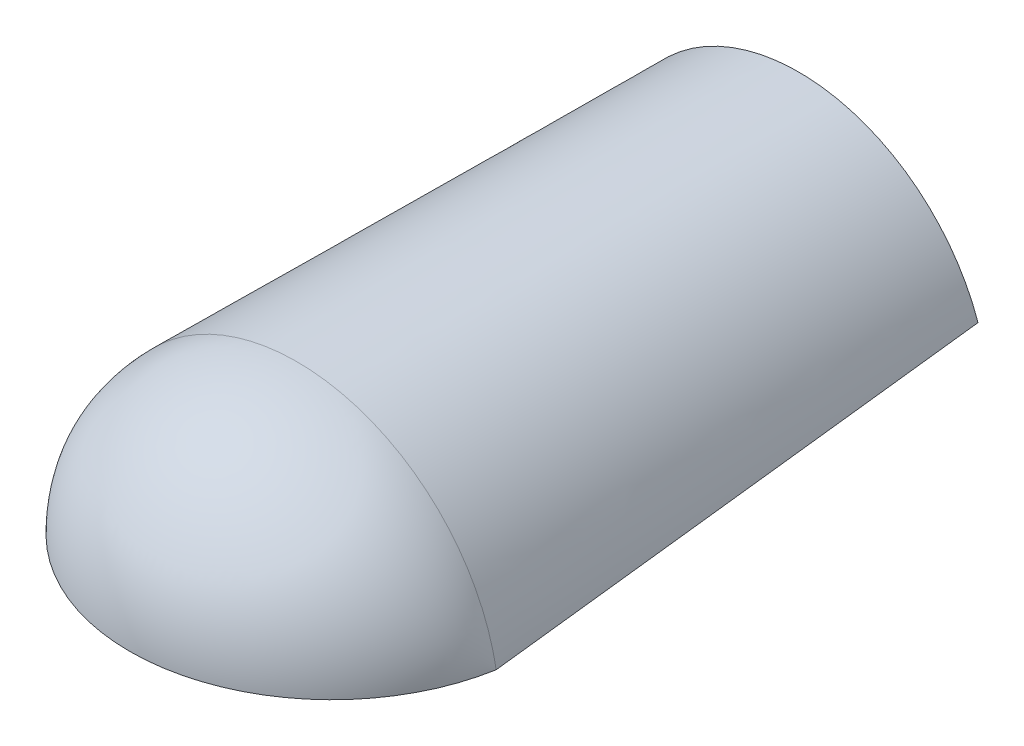
ISO-10303-21;
HEADER;
FILE_DESCRIPTION(('STEP AP214'),'2;1');
FILE_NAME('part.step','',(''),(''),'','','');
FILE_SCHEMA(('AUTOMOTIVE_DESIGN { 1 0 10303 214 1 1 1 1 }'));
ENDSEC;
DATA;
#1=APPLICATION_CONTEXT('core data for automotive mechanical design processes');
#2=APPLICATION_PROTOCOL_DEFINITION('international standard','automotive_design',2000,#1);
#3=PRODUCT_CONTEXT('',#1,'mechanical');
#4=PRODUCT('Part','Part','',(#3));
#5=PRODUCT_RELATED_PRODUCT_CATEGORY('part','',(#4));
#6=PRODUCT_DEFINITION_FORMATION('','',#4);
#7=PRODUCT_DEFINITION_CONTEXT('part definition',#1,'design');
#8=PRODUCT_DEFINITION('design','',#6,#7);
#9=PRODUCT_DEFINITION_SHAPE('','',#8);
#10=(LENGTH_UNIT() NAMED_UNIT(*) SI_UNIT(.MILLI.,.METRE.));
#11=(NAMED_UNIT(*) PLANE_ANGLE_UNIT() SI_UNIT($,.RADIAN.));
#12=(NAMED_UNIT(*) SI_UNIT($,.STERADIAN.) SOLID_ANGLE_UNIT());
#13=UNCERTAINTY_MEASURE_WITH_UNIT(LENGTH_MEASURE(1.E-05),#10,'distance_accuracy_value','');
#14=(GEOMETRIC_REPRESENTATION_CONTEXT(3) GLOBAL_UNCERTAINTY_ASSIGNED_CONTEXT((#13)) GLOBAL_UNIT_ASSIGNED_CONTEXT((#10,
#11,#12)) REPRESENTATION_CONTEXT('',''));
#15=CARTESIAN_POINT('',(0.,0.,0.));
#16=DIRECTION('',(0.,0.,1.));
#17=DIRECTION('',(1.,0.,0.));
#18=AXIS2_PLACEMENT_3D('',#15,#16,#17);
#19=CARTESIAN_POINT('',(125.,0.,-21.9047619047619));
#20=DIRECTION('',(0.,-1.,0.));
#21=DIRECTION('',(0.,0.,1.));
#22=AXIS2_PLACEMENT_3D('',#19,#20,#21);
#23=CIRCLE('',#22,126.904761904762);
#24=TRIMMED_CURVE('',#23,(PARAMETER_VALUE(-1.39731964944293)),
(PARAMETER_VALUE(1.39731964944293)),.T.,.PARAMETER.);
#25=CARTESIAN_POINT('',(125.,0.,0.));
#26=DIRECTION('',(-1.,0.,0.));
#27=AXIS1_PLACEMENT('',#25,#26);
#28=SURFACE_OF_REVOLUTION('',#24,#27);
#29=CARTESIAN_POINT('',(0.,0.,0.));
#30=CARTESIAN_POINT('',(0.898999374609131,5.13015947467167,0.));
#31=CARTESIAN_POINT('',(2.15965012983615,10.4731894749804,0.));
#32=CARTESIAN_POINT('',(5.60301441592827,21.4823689661564,0.));
#33=CARTESIAN_POINT('',(7.78666650616073,27.1492286482549,0.));
#34=CARTESIAN_POINT('',(13.2778334580457,38.6214063291952,0.));
#35=CARTESIAN_POINT('',(16.5868849935141,44.4270636661809,0.));
#36=CARTESIAN_POINT('',(22.518659414071,53.0253216700943,0.));
#37=CARTESIAN_POINT('',(24.6568615101316,55.8722105933577,0.));
#38=CARTESIAN_POINT('',(29.2681133264981,61.4823400169498,0.));
#39=CARTESIAN_POINT('',(31.7412276913879,64.2455454841741,0.));
#40=CARTESIAN_POINT('',(37.027898456181,69.6374874978048,0.));
#41=CARTESIAN_POINT('',(39.8415147989359,72.2661671666139,0.));
#42=CARTESIAN_POINT('',(45.8053969730578,77.3340729095938,0.));
#43=CARTESIAN_POINT('',(48.9557100148846,79.7732200709137,0.));
#44=CARTESIAN_POINT('',(55.5781661251231,84.4049509131887,0.));
#45=CARTESIAN_POINT('',(59.0503349470975,86.5974367213035,0.));
#46=CARTESIAN_POINT('',(66.2895276460907,90.6792772094084,0.));
#47=CARTESIAN_POINT('',(70.0565478849854,92.5685219287518,0.));
#48=CARTESIAN_POINT('',(77.8459518755739,95.9910030209656,0.));
#49=CARTESIAN_POINT('',(81.8682972795076,97.5241277879856,0.));
#50=CARTESIAN_POINT('',(90.1169560305692,100.188549608351,0.));
#51=CARTESIAN_POINT('',(94.3431953545311,101.3197462266,0.));
#52=CARTESIAN_POINT('',(102.938029145358,103.144782345888,0.));
#53=CARTESIAN_POINT('',(107.306518379128,103.838545671315,0.));
#54=CARTESIAN_POINT('',(116.116733782103,104.76617506715,0.));
#55=CARTESIAN_POINT('',(120.558333333333,105.,0.));
#56=CARTESIAN_POINT('',(129.441666666667,105.,0.));
#57=CARTESIAN_POINT('',(133.883266217897,104.76617506715,0.));
#58=CARTESIAN_POINT('',(142.693481620872,103.838545671315,0.));
#59=CARTESIAN_POINT('',(147.061970854642,103.144782345889,0.));
#60=CARTESIAN_POINT('',(155.656804645469,101.3197462266,0.));
#61=CARTESIAN_POINT('',(159.883043969431,100.188549608351,0.));
#62=CARTESIAN_POINT('',(168.131702720492,97.5241277879856,0.));
#63=CARTESIAN_POINT('',(172.154048124426,95.9910030209656,0.));
#64=CARTESIAN_POINT('',(179.943452115015,92.5685219287518,0.));
#65=CARTESIAN_POINT('',(183.710472353909,90.6792772094084,0.));
#66=CARTESIAN_POINT('',(190.949665052903,86.5974367213035,0.));
#67=CARTESIAN_POINT('',(194.421833874877,84.4049509131887,0.));
#68=CARTESIAN_POINT('',(201.044289985115,79.7732200709137,0.));
#69=CARTESIAN_POINT('',(204.194603026942,77.3340729095938,0.));
#70=CARTESIAN_POINT('',(210.158485201064,72.2661671666139,0.));
#71=CARTESIAN_POINT('',(212.972101543819,69.6374874978048,0.));
#72=CARTESIAN_POINT('',(218.258772308612,64.2455454841742,0.));
#73=CARTESIAN_POINT('',(220.731886673502,61.4823400169498,0.));
#74=CARTESIAN_POINT('',(225.343138489868,55.8722105933577,0.));
#75=CARTESIAN_POINT('',(227.481340585929,53.0253216700943,0.));
#76=CARTESIAN_POINT('',(233.413115006486,44.4270636661809,0.));
#77=CARTESIAN_POINT('',(236.722166541954,38.6214063291952,0.));
#78=CARTESIAN_POINT('',(242.213333493839,27.1492286482549,0.));
#79=CARTESIAN_POINT('',(244.396985584072,21.4823689661564,0.));
#80=CARTESIAN_POINT('',(247.840349870164,10.4731894749805,0.));
#81=CARTESIAN_POINT('',(249.101000625391,5.13015947467167,0.));
#82=CARTESIAN_POINT('',(250.,0.,0.));
#83=B_SPLINE_CURVE_WITH_KNOTS('',3,(#29,#30,#31,#32,#33,#34,#35,#36,#37,#38,#39,#40,#41,#42,#43,
#44,#45,#46,#47,#48,#49,#50,#51,#52,#53,#54,#55,#56,#57,#58,#59,#60,#61,#62,#63,#64,#65,#66,#67,
#68,#69,#70,#71,#72,#73,#74,#75,#76,#77,#78,#79,#80,#81,#82),.UNSPECIFIED.,.F.,.F.,(4,2,2,2,2,2,
2,2,2,2,2,2,2,2,2,2,2,2,2,2,2,2,2,2,2,2,4),(0.,0.0625,0.125,0.1875,0.21875,0.25,0.28125,0.3125,
0.34375,0.375,0.40625,0.4375,0.46875,0.5,0.53125,0.5625,0.59375,0.625,0.65625,0.6875,0.71875,
0.75,0.78125,0.8125,0.875,0.9375,1.),.UNSPECIFIED.);
#84=CARTESIAN_POINT('',(250.,0.,0.));
#85=VERTEX_POINT('',#84);
#86=CARTESIAN_POINT('',(0.,0.,0.));
#87=VERTEX_POINT('',#86);
#88=EDGE_CURVE('E92',#85,#87,#83,.F.);
#89=ORIENTED_EDGE('',*,*,#88,.T.);
#90=CARTESIAN_POINT('',(125.,0.,-21.9047619047619));
#91=DIRECTION('',(0.,-1.,0.));
#92=DIRECTION('',(-1.,0.,0.));
#93=AXIS2_PLACEMENT_3D('',#90,#91,#92);
#94=CIRCLE('',#93,126.904761904762);
#95=EDGE_CURVE('E131',#85,#87,#94,.T.);
#96=ORIENTED_EDGE('',*,*,#95,.F.);
#97=EDGE_LOOP('',(#89,#96));
#98=FACE_BOUND('',#97,.T.);
#99=ADVANCED_FACE('F65',(#98),#28,.T.);
#100=CARTESIAN_POINT('',(125.,0.,-21.9047619047619));
#101=DIRECTION('',(0.,-1.,0.));
#102=DIRECTION('',(0.,0.,1.));
#103=AXIS2_PLACEMENT_3D('',#100,#101,#102);
#104=CIRCLE('',#103,101.904761904762);
#105=TRIMMED_CURVE('',#104,(PARAMETER_VALUE(-1.3541523446426)),
(PARAMETER_VALUE(1.3541523446426)),.T.,.PARAMETER.);
#106=CARTESIAN_POINT('',(125.,0.,0.));
#107=DIRECTION('',(-1.,0.,0.));
#108=AXIS1_PLACEMENT('',#106,#107);
#109=SURFACE_OF_REVOLUTION('',#105,#108);
#110=CARTESIAN_POINT('',(224.522670305624,0.,0.));
#111=CARTESIAN_POINT('',(223.631306825472,4.04984423676008,0.));
#112=CARTESIAN_POINT('',(222.449262678906,8.24616676603677,0.));
#113=CARTESIAN_POINT('',(219.361557672107,16.8422861127023,0.));
#114=CARTESIAN_POINT('',(217.455178325375,21.2424977271868,0.));
#115=CARTESIAN_POINT('',(212.780517968589,30.097417646579,0.));
#116=CARTESIAN_POINT('',(210.011152009878,34.5522354151853,0.));
#117=CARTESIAN_POINT('',(203.504022235063,43.2980524926841,0.));
#118=CARTESIAN_POINT('',(199.764945665066,47.5885560574828,0.));
#119=CARTESIAN_POINT('',(191.280428145553,55.7227022206628,0.));
#120=CARTESIAN_POINT('',(186.533843676961,59.5650149630144,0.));
#121=CARTESIAN_POINT('',(178.711113863869,64.7525299799295,0.));
#122=CARTESIAN_POINT('',(175.987349686377,66.3855443118685,0.));
#123=CARTESIAN_POINT('',(170.328541530824,69.4199955411557,0.));
#124=CARTESIAN_POINT('',(167.393504490901,70.8213606850689,0.));
#125=CARTESIAN_POINT('',(161.341621000425,73.356088483138,0.));
#126=CARTESIAN_POINT('',(158.224803267567,74.4893798096796,0.));
#127=CARTESIAN_POINT('',(151.846701573153,76.4566773063151,0.));
#128=CARTESIAN_POINT('',(148.58546816263,77.29062028062,0.));
#129=CARTESIAN_POINT('',(141.962559339329,78.635129362407,0.));
#130=CARTESIAN_POINT('',(138.600953246763,79.1456480586955,0.));
#131=CARTESIAN_POINT('',(131.826191167963,79.8280960966815,0.));
#132=CARTESIAN_POINT('',(128.413117218815,80.,0.));
#133=CARTESIAN_POINT('',(121.586882781185,80.,0.));
#134=CARTESIAN_POINT('',(118.173808832037,79.8280960966815,0.));
#135=CARTESIAN_POINT('',(111.399046753237,79.1456480586954,0.));
#136=CARTESIAN_POINT('',(108.037440660671,78.6351293624071,0.));
#137=CARTESIAN_POINT('',(101.414531837371,77.29062028062,0.));
#138=CARTESIAN_POINT('',(98.153298426847,76.4566773063152,0.));
#139=CARTESIAN_POINT('',(91.7751967324333,74.4893798096796,0.));
#140=CARTESIAN_POINT('',(88.6583789995754,73.3560884831381,0.));
#141=CARTESIAN_POINT('',(82.6064955090993,70.821360685069,0.));
#142=CARTESIAN_POINT('',(79.6714584691765,69.4199955411557,0.));
#143=CARTESIAN_POINT('',(74.0126503136229,66.3855443118686,0.));
#144=CARTESIAN_POINT('',(71.2888861361307,64.7525299799295,0.));
#145=CARTESIAN_POINT('',(63.4661563230392,59.5650149630145,0.));
#146=CARTESIAN_POINT('',(58.7195718544469,55.7227022206629,0.));
#147=CARTESIAN_POINT('',(50.2350543349339,47.5885560574829,0.));
#148=CARTESIAN_POINT('',(46.4959777649371,43.2980524926841,0.));
#149=CARTESIAN_POINT('',(39.9888479901224,34.5522354151854,0.));
#150=CARTESIAN_POINT('',(37.2194820314106,30.0974176465791,0.));
#151=CARTESIAN_POINT('',(32.5448216746246,21.2424977271869,0.));
#152=CARTESIAN_POINT('',(30.6384423278933,16.8422861127024,0.));
#153=CARTESIAN_POINT('',(27.5507373210941,8.24616676603684,0.));
#154=CARTESIAN_POINT('',(26.3686931745278,4.04984423676016,0.));
#155=CARTESIAN_POINT('',(25.4773296943761,0.,0.));
#156=B_SPLINE_CURVE_WITH_KNOTS('',3,(#110,#111,#112,#113,#114,#115,#116,#117,#118,#119,#120,
#121,#122,#123,#124,#125,#126,#127,#128,#129,#130,#131,#132,#133,#134,#135,#136,#137,#138,#139,
#140,#141,#142,#143,#144,#145,#146,#147,#148,#149,#150,#151,#152,#153,#154,#155),.UNSPECIFIED.,
.F.,.F.,(4,2,2,2,2,2,2,2,2,2,2,2,2,2,2,2,2,2,2,2,2,2,4),(0.,0.0625,0.125,0.1875,0.25,0.3125,
0.34375,0.375,0.40625,0.4375,0.46875,0.5,0.53125,0.5625,0.59375,0.625,0.65625,0.6875,0.75,
0.8125,0.875,0.9375,1.),.UNSPECIFIED.);
#157=CARTESIAN_POINT('',(25.4773296943761,0.,0.));
#158=VERTEX_POINT('',#157);
#159=CARTESIAN_POINT('',(224.522670305624,0.,0.));
#160=VERTEX_POINT('',#159);
#161=EDGE_CURVE('E137',#158,#160,#156,.F.);
#162=ORIENTED_EDGE('',*,*,#161,.T.);
#163=CARTESIAN_POINT('',(125.,0.,-21.9047619047619));
#164=DIRECTION('',(0.,1.,0.));
#165=DIRECTION('',(-1.,0.,0.));
#166=AXIS2_PLACEMENT_3D('',#163,#164,#165);
#167=CIRCLE('',#166,101.904761904762);
#168=EDGE_CURVE('E76',#158,#160,#167,.T.);
#169=ORIENTED_EDGE('',*,*,#168,.F.);
#170=EDGE_LOOP('',(#162,#169));
#171=FACE_BOUND('',#170,.T.);
#172=ADVANCED_FACE('F67',(#171),#109,.F.);
#173=CARTESIAN_POINT('',(125.,0.,-21.9047619047619));
#174=DIRECTION('',(0.,1.,0.));
#175=DIRECTION('',(-1.,0.,0.));
#176=AXIS2_PLACEMENT_3D('',#173,#174,#175);
#177=PLANE('',#176);
#178=ORIENTED_EDGE('',*,*,#95,.T.);
#179=DIRECTION('',(-1.,0.,0.));
#180=VECTOR('',#179,1.);
#181=CARTESIAN_POINT('',(125.,0.,0.));
#182=LINE('',#181,#180);
#183=EDGE_CURVE('E124',#87,#158,#182,.F.);
#184=ORIENTED_EDGE('',*,*,#183,.T.);
#185=ORIENTED_EDGE('',*,*,#168,.T.);
#186=DIRECTION('',(-1.,0.,0.));
#187=VECTOR('',#186,1.);
#188=CARTESIAN_POINT('',(125.,0.,0.));
#189=LINE('',#188,#187);
#190=EDGE_CURVE('E12',#160,#85,#189,.F.);
#191=ORIENTED_EDGE('',*,*,#190,.T.);
#192=EDGE_LOOP('',(#178,#184,#185,#191));
#193=FACE_BOUND('',#192,.T.);
#194=ADVANCED_FACE('F140',(#193),#177,.F.);
#195=CARTESIAN_POINT('',(125.,-14.1015625000001,-315.));
#196=DIRECTION('',(0.,0.,1.));
#197=DIRECTION('',(1.,0.,0.));
#198=AXIS2_PLACEMENT_3D('',#195,#196,#197);
#199=PLANE('',#198);
#200=CARTESIAN_POINT('',(125.,-14.1015625000001,-315.));
#201=DIRECTION('',(0.,0.,-1.));
#202=DIRECTION('',(1.,0.,0.));
#203=AXIS2_PLACEMENT_3D('',#200,#201,#202);
#204=CIRCLE('',#203,119.1015625);
#205=CARTESIAN_POINT('',(12.5,25.,-315.));
#206=VERTEX_POINT('',#205);
#207=CARTESIAN_POINT('',(237.5,25.,-315.));
#208=VERTEX_POINT('',#207);
#209=EDGE_CURVE('E117',#206,#208,#204,.T.);
#210=ORIENTED_EDGE('',*,*,#209,.T.);
#211=DIRECTION('',(-1.,0.,0.));
#212=VECTOR('',#211,1.);
#213=CARTESIAN_POINT('',(237.5,25.,-315.));
#214=LINE('',#213,#212);
#215=CARTESIAN_POINT('',(210.593059736173,25.,-315.));
#216=VERTEX_POINT('',#215);
#217=EDGE_CURVE('E214',#208,#216,#214,.T.);
#218=ORIENTED_EDGE('',*,*,#217,.T.);
#219=CARTESIAN_POINT('',(125.,-14.1015625000001,-315.));
#220=DIRECTION('',(0.,0.,1.));
#221=DIRECTION('',(1.,0.,0.));
#222=AXIS2_PLACEMENT_3D('',#219,#220,#221);
#223=CIRCLE('',#222,94.1015625);
#224=CARTESIAN_POINT('',(39.4069402638275,25.,-315.));
#225=VERTEX_POINT('',#224);
#226=EDGE_CURVE('E211',#216,#225,#223,.T.);
#227=ORIENTED_EDGE('',*,*,#226,.T.);
#228=DIRECTION('',(-1.,0.,0.));
#229=VECTOR('',#228,1.);
#230=CARTESIAN_POINT('',(39.4069402638275,25.,-315.));
#231=LINE('',#230,#229);
#232=EDGE_CURVE('E111',#225,#206,#231,.T.);
#233=ORIENTED_EDGE('',*,*,#232,.T.);
#234=EDGE_LOOP('',(#210,#218,#227,#233));
#235=FACE_BOUND('',#234,.T.);
#236=ADVANCED_FACE('F172',(#235),#199,.F.);
#237=CARTESIAN_POINT('',(224.522670305624,0.,0.));
#238=CARTESIAN_POINT('',(210.593059736173,25.,-315.));
#239=CARTESIAN_POINT('',(223.631306825472,4.04984423676008,0.));
#240=CARTESIAN_POINT('',(209.111140322932,28.2439117199391,-315.));
#241=CARTESIAN_POINT('',(222.449262678906,8.24616676603677,0.));
#242=CARTESIAN_POINT('',(207.390210056382,31.5231634167147,-315.));
#243=CARTESIAN_POINT('',(219.361557672107,16.8422861127023,0.));
#244=CARTESIAN_POINT('',(203.411457315618,38.0655314362264,-315.));
#245=CARTESIAN_POINT('',(217.455178325375,21.2424977271868,0.));
#246=CARTESIAN_POINT('',(201.153269798506,41.3286196924426,-315.));
#247=CARTESIAN_POINT('',(212.780517968589,30.097417646579,0.));
#248=CARTESIAN_POINT('',(196.057830323655,47.7256996792851,-315.));
#249=CARTESIAN_POINT('',(210.011152009878,34.5522354151853,0.));
#250=CARTESIAN_POINT('',(193.220178282777,50.8594955632716,-315.));
#251=CARTESIAN_POINT('',(203.504022235063,43.2980524926841,0.));
#252=CARTESIAN_POINT('',(186.952600065985,56.861858603395,-315.));
#253=CARTESIAN_POINT('',(199.764945665066,47.5885560574828,0.));
#254=CARTESIAN_POINT('',(183.52232632854,59.7300237679969,-315.));
#255=CARTESIAN_POINT('',(191.280428145553,55.7227022206628,0.));
#256=CARTESIAN_POINT('',(176.096855438839,65.0506779863889,-315.));
#257=CARTESIAN_POINT('',(186.533843676961,59.5650149630144,0.));
#258=CARTESIAN_POINT('',(172.1014827071,67.5025735704193,-315.));
#259=CARTESIAN_POINT('',(178.711113863869,64.7525299799295,0.));
#260=CARTESIAN_POINT('',(165.741911367485,70.7563828032049,-315.));
#261=CARTESIAN_POINT('',(175.987349686377,66.3855443118685,0.));
#262=CARTESIAN_POINT('',(163.56099636701,71.7701405338807,-315.));
#263=CARTESIAN_POINT('',(170.328541530824,69.4199955411557,0.));
#264=CARTESIAN_POINT('',(159.092838275537,73.6399843415263,-315.));
#265=CARTESIAN_POINT('',(167.393504490901,70.8213606850689,0.));
#266=CARTESIAN_POINT('',(156.805595184538,74.496070418496,-315.));
#267=CARTESIAN_POINT('',(161.341621000425,73.356088483138,0.));
#268=CARTESIAN_POINT('',(152.140568596034,76.0345899588623,-315.));
#269=CARTESIAN_POINT('',(158.224803267567,74.4893798096796,0.));
#270=CARTESIAN_POINT('',(149.762896504437,76.7168670460819,-315.));
#271=CARTESIAN_POINT('',(151.846701573153,76.4566773063151,0.));
#272=CARTESIAN_POINT('',(144.938194578224,77.8965741289247,-315.));
#273=CARTESIAN_POINT('',(148.58546816263,77.29062028062,0.));
#274=CARTESIAN_POINT('',(142.491164743608,78.3940041245479,-315.));
#275=CARTESIAN_POINT('',(141.962559339329,78.635129362407,0.));
#276=CARTESIAN_POINT('',(137.548707183029,79.1931352985289,-315.));
#277=CARTESIAN_POINT('',(138.600953246763,79.1456480586955,0.));
#278=CARTESIAN_POINT('',(135.053459756865,79.4947428706443,-315.));
#279=CARTESIAN_POINT('',(131.826191167963,79.8280960966815,0.));
#280=CARTESIAN_POINT('',(130.038842730016,79.8981752213798,-315.));
#281=CARTESIAN_POINT('',(128.413117218815,80.,0.));
#282=CARTESIAN_POINT('',(127.519473129331,80.,-315.));
#283=CARTESIAN_POINT('',(121.586882781185,80.,0.));
#284=CARTESIAN_POINT('',(122.480526870669,79.9999999999999,-315.));
#285=CARTESIAN_POINT('',(118.173808832037,79.8280960966815,0.));
#286=CARTESIAN_POINT('',(119.961157269984,79.8981752213798,-315.));
#287=CARTESIAN_POINT('',(111.399046753237,79.1456480586954,0.));
#288=CARTESIAN_POINT('',(114.946540243135,79.4947428706443,-315.));
#289=CARTESIAN_POINT('',(108.037440660671,78.6351293624071,0.));
#290=CARTESIAN_POINT('',(112.451292816971,79.1931352985289,-315.));
#291=CARTESIAN_POINT('',(101.414531837371,77.29062028062,0.));
#292=CARTESIAN_POINT('',(107.508835256392,78.3940041245479,-315.));
#293=CARTESIAN_POINT('',(98.153298426847,76.4566773063152,0.));
#294=CARTESIAN_POINT('',(105.061805421776,77.8965741289247,-315.));
#295=CARTESIAN_POINT('',(91.7751967324333,74.4893798096796,0.));
#296=CARTESIAN_POINT('',(100.237103495563,76.7168670460819,-315.));
#297=CARTESIAN_POINT('',(88.6583789995754,73.3560884831381,0.));
#298=CARTESIAN_POINT('',(97.8594314039664,76.0345899588623,-315.));
#299=CARTESIAN_POINT('',(82.6064955090993,70.821360685069,0.));
#300=CARTESIAN_POINT('',(93.194404815462,74.496070418496,-315.));
#301=CARTESIAN_POINT('',(79.6714584691765,69.4199955411557,0.));
#302=CARTESIAN_POINT('',(90.9071617244634,73.6399843415263,-315.));
#303=CARTESIAN_POINT('',(74.0126503136229,66.3855443118686,0.));
#304=CARTESIAN_POINT('',(86.4390036329898,71.7701405338807,-315.));
#305=CARTESIAN_POINT('',(71.2888861361307,64.7525299799295,0.));
#306=CARTESIAN_POINT('',(84.2580886325149,70.7563828032049,-315.));
#307=CARTESIAN_POINT('',(63.4661563230392,59.5650149630145,0.));
#308=CARTESIAN_POINT('',(77.8985172929002,67.5025735704193,-315.));
#309=CARTESIAN_POINT('',(58.7195718544469,55.7227022206629,0.));
#310=CARTESIAN_POINT('',(73.9031445611609,65.050677986389,-315.));
#311=CARTESIAN_POINT('',(50.2350543349339,47.5885560574829,0.));
#312=CARTESIAN_POINT('',(66.4776736714603,59.730023767997,-315.));
#313=CARTESIAN_POINT('',(46.4959777649371,43.2980524926841,0.));
#314=CARTESIAN_POINT('',(63.047399934015,56.861858603395,-315.));
#315=CARTESIAN_POINT('',(39.9888479901224,34.5522354151854,0.));
#316=CARTESIAN_POINT('',(56.7798217172227,50.8594955632716,-315.));
#317=CARTESIAN_POINT('',(37.2194820314106,30.0974176465791,0.));
#318=CARTESIAN_POINT('',(53.9421696763452,47.7256996792851,-315.));
#319=CARTESIAN_POINT('',(32.5448216746246,21.2424977271869,0.));
#320=CARTESIAN_POINT('',(48.8467302014943,41.3286196924426,-315.));
#321=CARTESIAN_POINT('',(30.6384423278933,16.8422861127024,0.));
#322=CARTESIAN_POINT('',(46.5885426843816,38.0655314362265,-315.));
#323=CARTESIAN_POINT('',(27.5507373210941,8.24616676603684,0.));
#324=CARTESIAN_POINT('',(42.6097899436178,31.5231634167147,-315.));
#325=CARTESIAN_POINT('',(26.3686931745278,4.04984423676016,0.));
#326=CARTESIAN_POINT('',(40.8888596770679,28.2439117199391,-315.));
#327=CARTESIAN_POINT('',(25.4773296943761,0.,0.));
#328=CARTESIAN_POINT('',(39.4069402638275,25.,-315.));
#329=B_SPLINE_SURFACE_WITH_KNOTS('',3,1,((#237,#238),(#239,#240),(#241,#242),(#243,#244),(#245,
#246),(#247,#248),(#249,#250),(#251,#252),(#253,#254),(#255,#256),(#257,#258),(#259,#260),(#261,
#262),(#263,#264),(#265,#266),(#267,#268),(#269,#270),(#271,#272),(#273,#274),(#275,#276),(#277,
#278),(#279,#280),(#281,#282),(#283,#284),(#285,#286),(#287,#288),(#289,#290),(#291,#292),(#293,
#294),(#295,#296),(#297,#298),(#299,#300),(#301,#302),(#303,#304),(#305,#306),(#307,#308),(#309,
#310),(#311,#312),(#313,#314),(#315,#316),(#317,#318),(#319,#320),(#321,#322),(#323,#324),(#325,
#326),(#327,#328)),.UNSPECIFIED.,.F.,.F.,.F.,(4,2,2,2,2,2,2,2,2,2,2,2,2,2,2,2,2,2,2,2,2,2,4),(2,
2),(0.,0.0625,0.125,0.1875,0.25,0.3125,0.34375,0.375,0.40625,0.4375,0.46875,0.5,0.53125,0.5625,
0.59375,0.625,0.65625,0.6875,0.75,0.8125,0.875,0.9375,1.),(0.,1.),.UNSPECIFIED.);
#330=DIRECTION('',(0.0440396011756584,0.0790395412637028,-0.995898219922655));
#331=VECTOR('',#330,1.);
#332=CARTESIAN_POINT('',(32.4421349791018,12.5,-157.5));
#333=LINE('',#332,#331);
#334=EDGE_CURVE('E83',#158,#225,#333,.T.);
#335=DIRECTION('',(0.0440396011756583,-0.0790395412637028,0.995898219922655));
#336=VECTOR('',#335,1.);
#337=CARTESIAN_POINT('',(217.557865020898,12.5,-157.5));
#338=LINE('',#337,#336);
#339=EDGE_CURVE('E120',#216,#160,#338,.T.);
#340=ORIENTED_EDGE('',*,*,#161,.F.);
#341=ORIENTED_EDGE('',*,*,#334,.T.);
#342=ORIENTED_EDGE('',*,*,#226,.F.);
#343=ORIENTED_EDGE('',*,*,#339,.T.);
#344=EDGE_LOOP('',(#340,#341,#342,#343));
#345=FACE_BOUND('',#344,.T.);
#346=ADVANCED_FACE('F181',(#345),#329,.T.);
#347=CARTESIAN_POINT('',(12.5,25.,-315.));
#348=DIRECTION('',(0.,0.996865392576337,0.079116300998122));
#349=DIRECTION('',(0.,-0.079116300998122,0.996865392576337));
#350=AXIS2_PLACEMENT_3D('',#347,#348,#349);
#351=PLANE('',#350);
#352=DIRECTION('',(0.0395272355452937,0.0790544710905875,-0.996086335741403));
#353=VECTOR('',#352,1.);
#354=CARTESIAN_POINT('',(0.,0.,0.));
#355=LINE('',#354,#353);
#356=EDGE_CURVE('E115',#87,#206,#355,.T.);
#357=ORIENTED_EDGE('',*,*,#356,.T.);
#358=ORIENTED_EDGE('',*,*,#232,.F.);
#359=ORIENTED_EDGE('',*,*,#334,.F.);
#360=ORIENTED_EDGE('',*,*,#183,.F.);
#361=EDGE_LOOP('',(#357,#358,#359,#360));
#362=FACE_BOUND('',#361,.T.);
#363=ADVANCED_FACE('F125',(#362),#351,.F.);
#364=CARTESIAN_POINT('',(210.593059736173,25.,-315.));
#365=DIRECTION('',(0.,0.996865392576337,0.079116300998122));
#366=DIRECTION('',(0.,-0.079116300998122,0.996865392576337));
#367=AXIS2_PLACEMENT_3D('',#364,#365,#366);
#368=PLANE('',#367);
#369=ORIENTED_EDGE('',*,*,#339,.F.);
#370=ORIENTED_EDGE('',*,*,#217,.F.);
#371=DIRECTION('',(-0.0395272355452936,0.0790544710905876,-0.996086335741403));
#372=VECTOR('',#371,1.);
#373=CARTESIAN_POINT('',(243.75,12.5,-157.5));
#374=LINE('',#373,#372);
#375=EDGE_CURVE('E121',#85,#208,#374,.T.);
#376=ORIENTED_EDGE('',*,*,#375,.F.);
#377=ORIENTED_EDGE('',*,*,#190,.F.);
#378=EDGE_LOOP('',(#369,#370,#376,#377));
#379=FACE_BOUND('',#378,.T.);
#380=ADVANCED_FACE('F237',(#379),#368,.F.);
#381=CARTESIAN_POINT('',(0.,0.,0.));
#382=CARTESIAN_POINT('',(12.5,25.,-315.));
#383=CARTESIAN_POINT('',(0.898999374609131,5.13015947467167,0.));
#384=CARTESIAN_POINT('',(14.0389266972778,29.4276812069531,-315.));
#385=CARTESIAN_POINT('',(2.15965012983615,10.4731894749804,0.));
#386=CARTESIAN_POINT('',(15.9041852930132,33.9522940680042,-315.));
#387=CARTESIAN_POINT('',(5.60301441592827,21.4823689661564,0.));
#388=CARTESIAN_POINT('',(20.3998819907177,43.0813477974283,-315.));
#389=CARTESIAN_POINT('',(7.78666650616073,27.1492286482549,0.));
#390=CARTESIAN_POINT('',(23.0309655156587,47.68591132769,-315.));
#391=CARTESIAN_POINT('',(13.2778334580457,38.6214063291952,0.));
#392=CARTESIAN_POINT('',(29.1532905397046,56.8123585685037,-315.));
#393=CARTESIAN_POINT('',(16.5868849935141,44.4270636661809,0.));
#394=CARTESIAN_POINT('',(32.6453395684982,61.3340684451057,-315.));
#395=CARTESIAN_POINT('',(22.518659414071,53.0253216700943,0.));
#396=CARTESIAN_POINT('',(38.5694049580189,67.896110107344,-315.));
#397=CARTESIAN_POINT('',(24.6568615101316,55.8722105933577,0.));
#398=CARTESIAN_POINT('',(40.658629071642,70.0465511899691,-315.));
#399=CARTESIAN_POINT('',(29.2681133264981,61.4823400169498,0.));
#400=CARTESIAN_POINT('',(45.0645643762187,74.2426557792388,-315.));
#401=CARTESIAN_POINT('',(31.7412276913879,64.2455454841741,0.));
#402=CARTESIAN_POINT('',(47.3812755671722,76.2883192858835,-315.));
#403=CARTESIAN_POINT('',(37.027898456181,69.6374874978048,0.));
#404=CARTESIAN_POINT('',(52.2406008028409,80.2439034234545,-315.));
#405=CARTESIAN_POINT('',(39.8415147989359,72.2661671666139,0.));
#406=CARTESIAN_POINT('',(54.7833529834592,82.1535521743776,-315.));
#407=CARTESIAN_POINT('',(45.8053969730578,77.3340729095938,0.));
#408=CARTESIAN_POINT('',(60.0826186657552,85.8041982140665,-315.));
#409=CARTESIAN_POINT('',(48.9557100148846,79.7732200709137,0.));
#410=CARTESIAN_POINT('',(62.8391321674328,87.5451955028323,-315.));
#411=CARTESIAN_POINT('',(55.5781661251231,84.4049509131887,0.));
#412=CARTESIAN_POINT('',(68.5535026873389,90.8261737917736,-315.));
#413=CARTESIAN_POINT('',(59.0503349470975,86.5974367213035,0.));
#414=CARTESIAN_POINT('',(71.5113545792193,92.3658008191795,-315.));
#415=CARTESIAN_POINT('',(66.2895276460907,90.6792772094084,0.));
#416=CARTESIAN_POINT('',(77.6040733784843,95.2143245826057,-315.));
#417=CARTESIAN_POINT('',(70.0565478849854,92.5685219287518,0.));
#418=CARTESIAN_POINT('',(80.7389402858691,96.5232213186261,-315.));
#419=CARTESIAN_POINT('',(77.8459518755739,95.9910030209656,0.));
#420=CARTESIAN_POINT('',(87.161370867793,98.8812784420249,-315.));
#421=CARTESIAN_POINT('',(81.8682972795076,97.5241277879856,0.));
#422=CARTESIAN_POINT('',(90.4487378203124,99.9300955661804,-315.));
#423=CARTESIAN_POINT('',(90.1169560305692,100.188549608351,0.));
#424=CARTESIAN_POINT('',(97.1410519984541,101.746999829655,-315.));
#425=CARTESIAN_POINT('',(94.3431953545311,101.3197462266,0.));
#426=CARTESIAN_POINT('',(100.545999224076,102.515086968973,-315.));
#427=CARTESIAN_POINT('',(102.938029145358,103.144782345888,0.));
#428=CARTESIAN_POINT('',(107.438750898413,103.750224153026,-315.));
#429=CARTESIAN_POINT('',(107.306518379128,103.838545671315,0.));
#430=CARTESIAN_POINT('',(110.926189540509,104.217060262776,-315.));
#431=CARTESIAN_POINT('',(116.116733782103,104.76617506715,0.));
#432=CARTESIAN_POINT('',(117.94234649871,104.841948186263,-315.));
#433=CARTESIAN_POINT('',(120.558333333333,105.,0.));
#434=CARTESIAN_POINT('',(121.471064814815,105.,-315.));
#435=CARTESIAN_POINT('',(129.441666666667,105.,0.));
#436=CARTESIAN_POINT('',(128.528935185185,105.,-315.));
#437=CARTESIAN_POINT('',(133.883266217897,104.76617506715,0.));
#438=CARTESIAN_POINT('',(132.05765350129,104.841948186263,-315.));
#439=CARTESIAN_POINT('',(142.693481620872,103.838545671315,0.));
#440=CARTESIAN_POINT('',(139.073810459491,104.217060262776,-315.));
#441=CARTESIAN_POINT('',(147.061970854642,103.144782345889,0.));
#442=CARTESIAN_POINT('',(142.561249101588,103.750224153026,-315.));
#443=CARTESIAN_POINT('',(155.656804645469,101.3197462266,0.));
#444=CARTESIAN_POINT('',(149.454000775924,102.515086968973,-315.));
#445=CARTESIAN_POINT('',(159.883043969431,100.188549608351,0.));
#446=CARTESIAN_POINT('',(152.858948001546,101.746999829655,-315.));
#447=CARTESIAN_POINT('',(168.131702720492,97.5241277879856,0.));
#448=CARTESIAN_POINT('',(159.551262179688,99.9300955661804,-315.));
#449=CARTESIAN_POINT('',(172.154048124426,95.9910030209656,0.));
#450=CARTESIAN_POINT('',(162.838629132207,98.8812784420249,-315.));
#451=CARTESIAN_POINT('',(179.943452115015,92.5685219287518,0.));
#452=CARTESIAN_POINT('',(169.261059714131,96.523221318626,-315.));
#453=CARTESIAN_POINT('',(183.710472353909,90.6792772094084,0.));
#454=CARTESIAN_POINT('',(172.395926621516,95.2143245826057,-315.));
#455=CARTESIAN_POINT('',(190.949665052903,86.5974367213035,0.));
#456=CARTESIAN_POINT('',(178.488645420781,92.3658008191794,-315.));
#457=CARTESIAN_POINT('',(194.421833874877,84.4049509131887,0.));
#458=CARTESIAN_POINT('',(181.446497312661,90.8261737917735,-315.));
#459=CARTESIAN_POINT('',(201.044289985115,79.7732200709137,0.));
#460=CARTESIAN_POINT('',(187.160867832567,87.5451955028322,-315.));
#461=CARTESIAN_POINT('',(204.194603026942,77.3340729095938,0.));
#462=CARTESIAN_POINT('',(189.917381334245,85.8041982140665,-315.));
#463=CARTESIAN_POINT('',(210.158485201064,72.2661671666139,0.));
#464=CARTESIAN_POINT('',(195.216647016541,82.1535521743776,-315.));
#465=CARTESIAN_POINT('',(212.972101543819,69.6374874978048,0.));
#466=CARTESIAN_POINT('',(197.759399197159,80.2439034234544,-315.));
#467=CARTESIAN_POINT('',(218.258772308612,64.2455454841742,0.));
#468=CARTESIAN_POINT('',(202.618724432828,76.2883192858835,-315.));
#469=CARTESIAN_POINT('',(220.731886673502,61.4823400169498,0.));
#470=CARTESIAN_POINT('',(204.935435623781,74.2426557792388,-315.));
#471=CARTESIAN_POINT('',(225.343138489868,55.8722105933577,0.));
#472=CARTESIAN_POINT('',(209.341370928358,70.0465511899691,-315.));
#473=CARTESIAN_POINT('',(227.481340585929,53.0253216700943,0.));
#474=CARTESIAN_POINT('',(211.430595041981,67.896110107344,-315.));
#475=CARTESIAN_POINT('',(233.413115006486,44.4270636661809,0.));
#476=CARTESIAN_POINT('',(217.354660431502,61.3340684451058,-315.));
#477=CARTESIAN_POINT('',(236.722166541954,38.6214063291952,0.));
#478=CARTESIAN_POINT('',(220.846709460295,56.8123585685037,-315.));
#479=CARTESIAN_POINT('',(242.213333493839,27.1492286482549,0.));
#480=CARTESIAN_POINT('',(226.969034484341,47.6859113276901,-315.));
#481=CARTESIAN_POINT('',(244.396985584072,21.4823689661564,0.));
#482=CARTESIAN_POINT('',(229.600118009282,43.0813477974283,-315.));
#483=CARTESIAN_POINT('',(247.840349870164,10.4731894749805,0.));
#484=CARTESIAN_POINT('',(234.095814706987,33.9522940680042,-315.));
#485=CARTESIAN_POINT('',(249.101000625391,5.13015947467167,0.));
#486=CARTESIAN_POINT('',(235.961073302722,29.4276812069531,-315.));
#487=CARTESIAN_POINT('',(250.,0.,0.));
#488=CARTESIAN_POINT('',(237.5,25.,-315.));
#489=B_SPLINE_SURFACE_WITH_KNOTS('',3,1,((#381,#382),(#383,#384),(#385,#386),(#387,#388),(#389,
#390),(#391,#392),(#393,#394),(#395,#396),(#397,#398),(#399,#400),(#401,#402),(#403,#404),(#405,
#406),(#407,#408),(#409,#410),(#411,#412),(#413,#414),(#415,#416),(#417,#418),(#419,#420),(#421,
#422),(#423,#424),(#425,#426),(#427,#428),(#429,#430),(#431,#432),(#433,#434),(#435,#436),(#437,
#438),(#439,#440),(#441,#442),(#443,#444),(#445,#446),(#447,#448),(#449,#450),(#451,#452),(#453,
#454),(#455,#456),(#457,#458),(#459,#460),(#461,#462),(#463,#464),(#465,#466),(#467,#468),(#469,
#470),(#471,#472),(#473,#474),(#475,#476),(#477,#478),(#479,#480),(#481,#482),(#483,#484),(#485,
#486),(#487,#488)),.UNSPECIFIED.,.F.,.F.,.F.,(4,2,2,2,2,2,2,2,2,2,2,2,2,2,2,2,2,2,2,2,2,2,2,2,2,
2,4),(2,2),(0.,0.0625,0.125,0.1875,0.21875,0.25,0.28125,0.3125,0.34375,0.375,0.40625,0.4375,
0.46875,0.5,0.53125,0.5625,0.59375,0.625,0.65625,0.6875,0.71875,0.75,0.78125,0.8125,0.875,
0.9375,1.),(0.,1.),.UNSPECIFIED.);
#490=ORIENTED_EDGE('',*,*,#88,.F.);
#491=ORIENTED_EDGE('',*,*,#375,.T.);
#492=ORIENTED_EDGE('',*,*,#209,.F.);
#493=ORIENTED_EDGE('',*,*,#356,.F.);
#494=EDGE_LOOP('',(#490,#491,#492,#493));
#495=FACE_BOUND('',#494,.T.);
#496=ADVANCED_FACE('F116',(#495),#489,.T.);
#497=CLOSED_SHELL('',(#99,#172,#194,#236,#346,#363,#380,#496));
#498=MANIFOLD_SOLID_BREP('B2',#497);
#499=ADVANCED_BREP_SHAPE_REPRESENTATION('',(#18,#498),#14);
#500=SHAPE_DEFINITION_REPRESENTATION(#9,#499);
ENDSEC;
END-ISO-10303-21;
